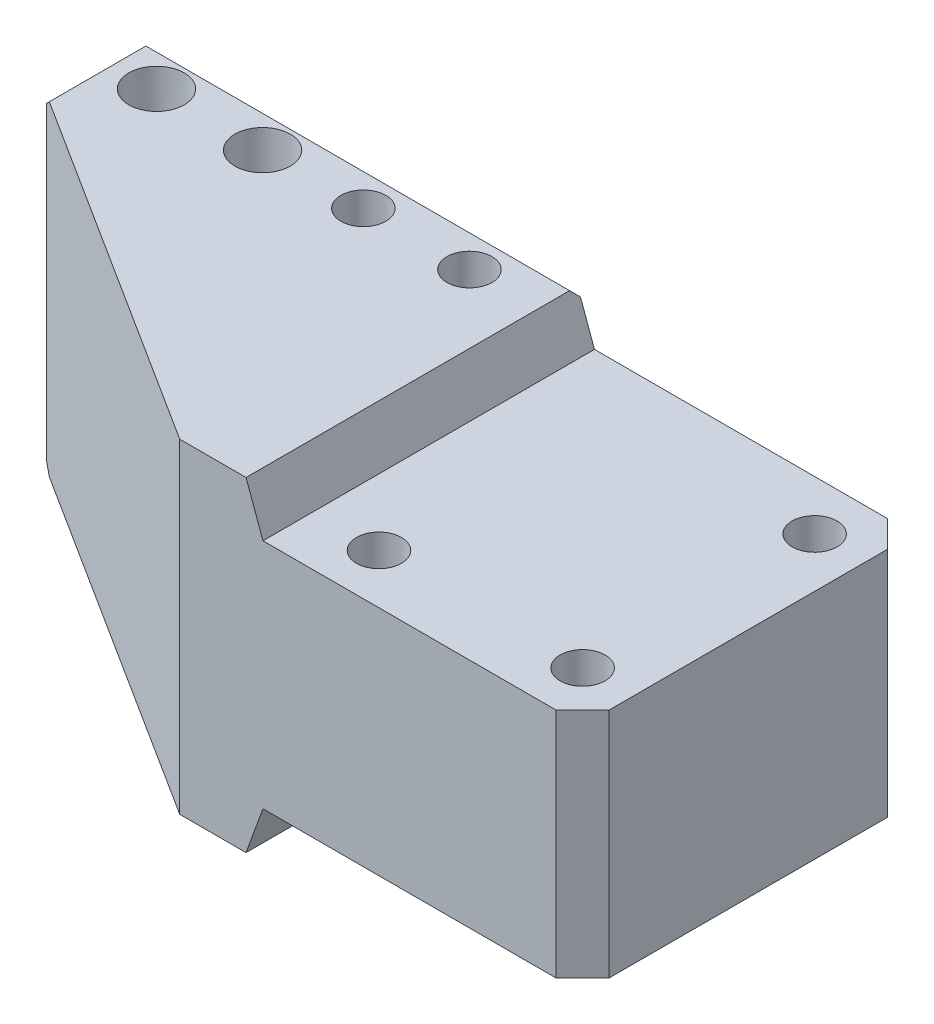
ISO-10303-21;
HEADER;
FILE_DESCRIPTION(('STEP AP214'),'2;1');
FILE_NAME('part.step','',(''),(''),'','','');
FILE_SCHEMA(('AUTOMOTIVE_DESIGN { 1 0 10303 214 1 1 1 1 }'));
ENDSEC;
DATA;
#1=APPLICATION_CONTEXT('core data for automotive mechanical design processes');
#2=APPLICATION_PROTOCOL_DEFINITION('international standard','automotive_design',2000,#1);
#3=PRODUCT_CONTEXT('',#1,'mechanical');
#4=PRODUCT('Part','Part','',(#3));
#5=PRODUCT_RELATED_PRODUCT_CATEGORY('part','',(#4));
#6=PRODUCT_DEFINITION_FORMATION('','',#4);
#7=PRODUCT_DEFINITION_CONTEXT('part definition',#1,'design');
#8=PRODUCT_DEFINITION('design','',#6,#7);
#9=PRODUCT_DEFINITION_SHAPE('','',#8);
#10=(LENGTH_UNIT() NAMED_UNIT(*) SI_UNIT(.MILLI.,.METRE.));
#11=(NAMED_UNIT(*) PLANE_ANGLE_UNIT() SI_UNIT($,.RADIAN.));
#12=(NAMED_UNIT(*) SI_UNIT($,.STERADIAN.) SOLID_ANGLE_UNIT());
#13=UNCERTAINTY_MEASURE_WITH_UNIT(LENGTH_MEASURE(1.E-05),#10,'distance_accuracy_value','');
#14=(GEOMETRIC_REPRESENTATION_CONTEXT(3) GLOBAL_UNCERTAINTY_ASSIGNED_CONTEXT((#13)) GLOBAL_UNIT_ASSIGNED_CONTEXT((#10,
#11,#12)) REPRESENTATION_CONTEXT('',''));
#15=CARTESIAN_POINT('',(0.,0.,0.));
#16=DIRECTION('',(0.,0.,1.));
#17=DIRECTION('',(1.,0.,0.));
#18=AXIS2_PLACEMENT_3D('',#15,#16,#17);
#19=CARTESIAN_POINT('',(23.1488063819966,-25.146,12.7));
#20=DIRECTION('',(0.,1.,0.));
#21=DIRECTION('',(-1.,0.,0.));
#22=AXIS2_PLACEMENT_3D('',#19,#20,#21);
#23=PLANE('',#22);
#24=DIRECTION('',(-0.844133683721906,0.,-0.536132748492465));
#25=VECTOR('',#24,1.);
#26=CARTESIAN_POINT('',(15.1809586906833,-25.146,31.75));
#27=LINE('',#26,#25);
#28=CARTESIAN_POINT('',(15.1809586906833,-25.146,31.75));
#29=VERTEX_POINT('',#28);
#30=CARTESIAN_POINT('',(-19.05,-25.146,10.0089673646833));
#31=VERTEX_POINT('',#30);
#32=EDGE_CURVE('E152',#29,#31,#27,.T.);
#33=ORIENTED_EDGE('',*,*,#32,.T.);
#34=DIRECTION('',(0.,0.,-1.));
#35=VECTOR('',#34,1.);
#36=CARTESIAN_POINT('',(-19.05,-25.146,12.7));
#37=LINE('',#36,#35);
#38=CARTESIAN_POINT('',(-19.05,-25.146,0.761999999999999));
#39=VERTEX_POINT('',#38);
#40=EDGE_CURVE('E49',#31,#39,#37,.T.);
#41=ORIENTED_EDGE('',*,*,#40,.T.);
#42=DIRECTION('',(1.,0.,0.));
#43=VECTOR('',#42,1.);
#44=CARTESIAN_POINT('',(21.5309586906833,-25.146,0.761999999999999));
#45=LINE('',#44,#43);
#46=CARTESIAN_POINT('',(21.5309586906833,-25.146,0.761999999999999));
#47=VERTEX_POINT('',#46);
#48=EDGE_CURVE('E60',#39,#47,#45,.T.);
#49=ORIENTED_EDGE('',*,*,#48,.T.);
#50=DIRECTION('',(0.,0.,1.));
#51=VECTOR('',#50,1.);
#52=CARTESIAN_POINT('',(21.5309586906833,-25.146,12.7));
#53=LINE('',#52,#51);
#54=CARTESIAN_POINT('',(21.5309586906833,-25.146,31.75));
#55=VERTEX_POINT('',#54);
#56=EDGE_CURVE('E206',#55,#47,#53,.F.);
#57=ORIENTED_EDGE('',*,*,#56,.F.);
#58=DIRECTION('',(1.,0.,0.));
#59=VECTOR('',#58,1.);
#60=CARTESIAN_POINT('',(-19.812,-25.146,31.75));
#61=LINE('',#60,#59);
#62=EDGE_CURVE('E173',#29,#55,#61,.T.);
#63=ORIENTED_EDGE('',*,*,#62,.F.);
#64=EDGE_LOOP('',(#33,#41,#49,#57,#63));
#65=FACE_BOUND('',#64,.T.);
#66=CARTESIAN_POINT('',(-4.826,-25.146,3.81000000000003));
#67=DIRECTION('',(0.,-1.,0.));
#68=DIRECTION('',(0.,0.,-1.));
#69=AXIS2_PLACEMENT_3D('',#66,#67,#68);
#70=CIRCLE('',#69,2.15265);
#71=CARTESIAN_POINT('',(-4.826,-25.146,1.65735000000003));
#72=VERTEX_POINT('',#71);
#73=EDGE_CURVE('E663',#72,#72,#70,.T.);
#74=ORIENTED_EDGE('',*,*,#73,.F.);
#75=EDGE_LOOP('',(#74));
#76=FACE_BOUND('',#75,.T.);
#77=CARTESIAN_POINT('',(-14.986,-25.146,3.81000000000003));
#78=DIRECTION('',(0.,-1.,0.));
#79=DIRECTION('',(0.,0.,-1.));
#80=AXIS2_PLACEMENT_3D('',#77,#78,#79);
#81=CIRCLE('',#80,2.15265);
#82=CARTESIAN_POINT('',(-14.986,-25.146,1.65735000000003));
#83=VERTEX_POINT('',#82);
#84=EDGE_CURVE('E217',#83,#83,#81,.T.);
#85=ORIENTED_EDGE('',*,*,#84,.F.);
#86=EDGE_LOOP('',(#85));
#87=FACE_BOUND('',#86,.T.);
#88=CARTESIAN_POINT('',(14.986,-25.146,3.81000000000001));
#89=DIRECTION('',(0.,-1.,0.));
#90=DIRECTION('',(0.,0.,-1.));
#91=AXIS2_PLACEMENT_3D('',#88,#89,#90);
#92=CIRCLE('',#91,2.65430000000001);
#93=CARTESIAN_POINT('',(14.986,-25.146,1.1557));
#94=VERTEX_POINT('',#93);
#95=EDGE_CURVE('E232',#94,#94,#92,.T.);
#96=ORIENTED_EDGE('',*,*,#95,.F.);
#97=EDGE_LOOP('',(#96));
#98=FACE_BOUND('',#97,.T.);
#99=CARTESIAN_POINT('',(4.826,-25.146,3.81000000000001));
#100=DIRECTION('',(0.,-1.,0.));
#101=DIRECTION('',(0.,0.,-1.));
#102=AXIS2_PLACEMENT_3D('',#99,#100,#101);
#103=CIRCLE('',#102,2.65430000000001);
#104=CARTESIAN_POINT('',(4.826,-25.146,1.1557));
#105=VERTEX_POINT('',#104);
#106=EDGE_CURVE('E156',#105,#105,#103,.T.);
#107=ORIENTED_EDGE('',*,*,#106,.F.);
#108=EDGE_LOOP('',(#107));
#109=FACE_BOUND('',#108,.T.);
#110=ADVANCED_FACE('F40',(#65,#76,#87,#98,#109),#23,.F.);
#111=CARTESIAN_POINT('',(23.1488063819966,5.969,12.7));
#112=DIRECTION('',(0.,-1.,0.));
#113=DIRECTION('',(1.,0.,0.));
#114=AXIS2_PLACEMENT_3D('',#111,#112,#113);
#115=PLANE('',#114);
#116=DIRECTION('',(-1.,0.,0.));
#117=VECTOR('',#116,1.);
#118=CARTESIAN_POINT('',(-19.812,5.969,0.761999999999999));
#119=LINE('',#118,#117);
#120=CARTESIAN_POINT('',(21.5309586906833,5.969,0.761999999999999));
#121=VERTEX_POINT('',#120);
#122=CARTESIAN_POINT('',(-19.05,5.969,0.761999999999999));
#123=VERTEX_POINT('',#122);
#124=EDGE_CURVE('E258',#121,#123,#119,.T.);
#125=ORIENTED_EDGE('',*,*,#124,.T.);
#126=DIRECTION('',(0.,0.,1.));
#127=VECTOR('',#126,1.);
#128=CARTESIAN_POINT('',(-19.05,5.969,12.7));
#129=LINE('',#128,#127);
#130=CARTESIAN_POINT('',(-19.05,5.969,10.0089673646833));
#131=VERTEX_POINT('',#130);
#132=EDGE_CURVE('E167',#123,#131,#129,.T.);
#133=ORIENTED_EDGE('',*,*,#132,.T.);
#134=DIRECTION('',(-0.844133683721906,0.,-0.536132748492465));
#135=VECTOR('',#134,1.);
#136=CARTESIAN_POINT('',(15.1809586906833,5.969,31.75));
#137=LINE('',#136,#135);
#138=CARTESIAN_POINT('',(15.1809586906833,5.969,31.75));
#139=VERTEX_POINT('',#138);
#140=EDGE_CURVE('E150',#139,#131,#137,.T.);
#141=ORIENTED_EDGE('',*,*,#140,.F.);
#142=DIRECTION('',(-1.,0.,0.));
#143=VECTOR('',#142,1.);
#144=CARTESIAN_POINT('',(23.1488063819966,5.969,31.75));
#145=LINE('',#144,#143);
#146=CARTESIAN_POINT('',(21.5309586906833,5.969,31.75));
#147=VERTEX_POINT('',#146);
#148=EDGE_CURVE('E164',#147,#139,#145,.T.);
#149=ORIENTED_EDGE('',*,*,#148,.F.);
#150=DIRECTION('',(0.,0.,1.));
#151=VECTOR('',#150,1.);
#152=CARTESIAN_POINT('',(21.5309586906833,5.969,12.7));
#153=LINE('',#152,#151);
#154=EDGE_CURVE('E200',#147,#121,#153,.F.);
#155=ORIENTED_EDGE('',*,*,#154,.T.);
#156=EDGE_LOOP('',(#125,#133,#141,#149,#155));
#157=FACE_BOUND('',#156,.T.);
#158=CARTESIAN_POINT('',(4.826,5.969,3.81000000000001));
#159=DIRECTION('',(0.,1.,0.));
#160=DIRECTION('',(0.,0.,1.));
#161=AXIS2_PLACEMENT_3D('',#158,#159,#160);
#162=CIRCLE('',#161,2.15265);
#163=CARTESIAN_POINT('',(4.826,5.969,5.96265000000001));
#164=VERTEX_POINT('',#163);
#165=EDGE_CURVE('E669',#164,#164,#162,.T.);
#166=ORIENTED_EDGE('',*,*,#165,.F.);
#167=EDGE_LOOP('',(#166));
#168=FACE_BOUND('',#167,.T.);
#169=CARTESIAN_POINT('',(14.986,5.969,3.81000000000001));
#170=DIRECTION('',(0.,1.,0.));
#171=DIRECTION('',(0.,0.,1.));
#172=AXIS2_PLACEMENT_3D('',#169,#170,#171);
#173=CIRCLE('',#172,2.15265);
#174=CARTESIAN_POINT('',(14.986,5.969,5.96265000000001));
#175=VERTEX_POINT('',#174);
#176=EDGE_CURVE('E666',#175,#175,#173,.T.);
#177=ORIENTED_EDGE('',*,*,#176,.F.);
#178=EDGE_LOOP('',(#177));
#179=FACE_BOUND('',#178,.T.);
#180=CARTESIAN_POINT('',(-14.986,5.969,3.81000000000003));
#181=DIRECTION('',(0.,1.,0.));
#182=DIRECTION('',(0.,0.,1.));
#183=AXIS2_PLACEMENT_3D('',#180,#181,#182);
#184=CIRCLE('',#183,2.65430000000001);
#185=CARTESIAN_POINT('',(-14.986,5.969,6.46430000000004));
#186=VERTEX_POINT('',#185);
#187=EDGE_CURVE('E222',#186,#186,#184,.T.);
#188=ORIENTED_EDGE('',*,*,#187,.F.);
#189=EDGE_LOOP('',(#188));
#190=FACE_BOUND('',#189,.T.);
#191=CARTESIAN_POINT('',(-4.826,5.969,3.81000000000003));
#192=DIRECTION('',(0.,1.,0.));
#193=DIRECTION('',(0.,0.,1.));
#194=AXIS2_PLACEMENT_3D('',#191,#192,#193);
#195=CIRCLE('',#194,2.65430000000001);
#196=CARTESIAN_POINT('',(-4.826,5.969,6.46430000000004));
#197=VERTEX_POINT('',#196);
#198=EDGE_CURVE('E227',#197,#197,#195,.T.);
#199=ORIENTED_EDGE('',*,*,#198,.F.);
#200=EDGE_LOOP('',(#199));
#201=FACE_BOUND('',#200,.T.);
#202=ADVANCED_FACE('F161',(#157,#168,#179,#190,#201),#115,.F.);
#203=CARTESIAN_POINT('',(23.1488063819966,1.52400000000002,31.75));
#204=DIRECTION('',(0.939692620785908,0.34202014332567,0.));
#205=DIRECTION('',(-0.34202014332567,0.939692620785908,0.));
#206=AXIS2_PLACEMENT_3D('',#203,#204,#205);
#207=PLANE('',#206);
#208=DIRECTION('',(0.34202014332567,-0.939692620785908,0.));
#209=VECTOR('',#208,1.);
#210=CARTESIAN_POINT('',(20.9307145964622,7.61815709503341,0.));
#211=LINE('',#210,#209);
#212=CARTESIAN_POINT('',(23.1488063819966,1.52400000000002,0.));
#213=VERTEX_POINT('',#212);
#214=CARTESIAN_POINT('',(21.8083040091942,5.207,0.));
#215=VERTEX_POINT('',#214);
#216=EDGE_CURVE('E195',#213,#215,#211,.F.);
#217=ORIENTED_EDGE('',*,*,#216,.T.);
#218=DIRECTION('',(0.249243569363955,-0.684791078771736,-0.684791078771736));
#219=VECTOR('',#218,1.);
#220=CARTESIAN_POINT('',(21.6314632023232,5.69286612371603,0.48586612371603));
#221=LINE('',#220,#219);
#222=EDGE_CURVE('E271',#215,#121,#221,.F.);
#223=ORIENTED_EDGE('',*,*,#222,.T.);
#224=ORIENTED_EDGE('',*,*,#154,.F.);
#225=DIRECTION('',(0.34202014332567,-0.939692620785908,0.));
#226=VECTOR('',#225,1.);
#227=CARTESIAN_POINT('',(20.9307145964622,7.61815709503341,31.75));
#228=LINE('',#227,#226);
#229=CARTESIAN_POINT('',(23.1488063819966,1.52400000000002,31.75));
#230=VERTEX_POINT('',#229);
#231=EDGE_CURVE('E172',#230,#147,#228,.F.);
#232=ORIENTED_EDGE('',*,*,#231,.F.);
#233=DIRECTION('',(0.,0.,-1.));
#234=VECTOR('',#233,1.);
#235=CARTESIAN_POINT('',(23.1488063819966,1.52400000000002,31.75));
#236=LINE('',#235,#234);
#237=EDGE_CURVE('E199',#230,#213,#236,.T.);
#238=ORIENTED_EDGE('',*,*,#237,.T.);
#239=EDGE_LOOP('',(#217,#223,#224,#232,#238));
#240=FACE_BOUND('',#239,.T.);
#241=ADVANCED_FACE('F312',(#240),#207,.T.);
#242=CARTESIAN_POINT('',(23.1488063819966,-20.701,12.7));
#243=DIRECTION('',(0.939692620785908,-0.342020143325669,0.));
#244=DIRECTION('',(0.342020143325669,0.939692620785908,0.));
#245=AXIS2_PLACEMENT_3D('',#242,#243,#244);
#246=PLANE('',#245);
#247=ORIENTED_EDGE('',*,*,#56,.T.);
#248=DIRECTION('',(-0.249243569363955,-0.684791078771736,0.684791078771736));
#249=VECTOR('',#248,1.);
#250=CARTESIAN_POINT('',(21.6314632023232,-24.869866123716,0.485866123716031));
#251=LINE('',#250,#249);
#252=CARTESIAN_POINT('',(21.8083040091942,-24.384,0.));
#253=VERTEX_POINT('',#252);
#254=EDGE_CURVE('E11',#47,#253,#251,.F.);
#255=ORIENTED_EDGE('',*,*,#254,.T.);
#256=DIRECTION('',(-0.342020143325669,-0.939692620785908,0.));
#257=VECTOR('',#256,1.);
#258=CARTESIAN_POINT('',(27.0940835919416,-9.86143995218708,0.));
#259=LINE('',#258,#257);
#260=CARTESIAN_POINT('',(23.1488063819966,-20.701,0.));
#261=VERTEX_POINT('',#260);
#262=EDGE_CURVE('E204',#253,#261,#259,.F.);
#263=ORIENTED_EDGE('',*,*,#262,.T.);
#264=DIRECTION('',(0.,0.,-1.));
#265=VECTOR('',#264,1.);
#266=CARTESIAN_POINT('',(23.1488063819966,-20.701,12.7));
#267=LINE('',#266,#265);
#268=CARTESIAN_POINT('',(23.1488063819966,-20.701,31.75));
#269=VERTEX_POINT('',#268);
#270=EDGE_CURVE('E196',#269,#261,#267,.T.);
#271=ORIENTED_EDGE('',*,*,#270,.F.);
#272=DIRECTION('',(-0.342020143325669,-0.939692620785908,0.));
#273=VECTOR('',#272,1.);
#274=CARTESIAN_POINT('',(27.0940835919416,-9.86143995218708,31.75));
#275=LINE('',#274,#273);
#276=EDGE_CURVE('E177',#55,#269,#275,.F.);
#277=ORIENTED_EDGE('',*,*,#276,.F.);
#278=EDGE_LOOP('',(#247,#255,#263,#271,#277));
#279=FACE_BOUND('',#278,.T.);
#280=ADVANCED_FACE('F337',(#279),#246,.T.);
#281=CARTESIAN_POINT('',(-19.812,5.969,12.7));
#282=DIRECTION('',(1.,0.,0.));
#283=DIRECTION('',(0.,1.,0.));
#284=AXIS2_PLACEMENT_3D('',#281,#282,#283);
#285=PLANE('',#284);
#286=DIRECTION('',(0.,1.,0.));
#287=VECTOR('',#286,1.);
#288=CARTESIAN_POINT('',(-19.812,-25.146,9.525));
#289=LINE('',#288,#287);
#290=CARTESIAN_POINT('',(-19.812,-24.384,9.525));
#291=VERTEX_POINT('',#290);
#292=CARTESIAN_POINT('',(-19.812,5.20699999999999,9.525));
#293=VERTEX_POINT('',#292);
#294=EDGE_CURVE('E157',#291,#293,#289,.T.);
#295=ORIENTED_EDGE('',*,*,#294,.T.);
#296=DIRECTION('',(0.,0.,-1.));
#297=VECTOR('',#296,1.);
#298=CARTESIAN_POINT('',(-19.812,5.207,12.7));
#299=LINE('',#298,#297);
#300=CARTESIAN_POINT('',(-19.812,5.207,0.761999999999999));
#301=VERTEX_POINT('',#300);
#302=EDGE_CURVE('E255',#293,#301,#299,.T.);
#303=ORIENTED_EDGE('',*,*,#302,.T.);
#304=DIRECTION('',(0.,-1.,0.));
#305=VECTOR('',#304,1.);
#306=CARTESIAN_POINT('',(-19.812,-25.146,0.761999999999999));
#307=LINE('',#306,#305);
#308=CARTESIAN_POINT('',(-19.812,-24.384,0.761999999999999));
#309=VERTEX_POINT('',#308);
#310=EDGE_CURVE('E251',#301,#309,#307,.T.);
#311=ORIENTED_EDGE('',*,*,#310,.T.);
#312=DIRECTION('',(0.,0.,1.));
#313=VECTOR('',#312,1.);
#314=CARTESIAN_POINT('',(-19.812,-24.384,12.7));
#315=LINE('',#314,#313);
#316=EDGE_CURVE('E253',#309,#291,#315,.T.);
#317=ORIENTED_EDGE('',*,*,#316,.T.);
#318=EDGE_LOOP('',(#295,#303,#311,#317));
#319=FACE_BOUND('',#318,.T.);
#320=ADVANCED_FACE('F357',(#319),#285,.F.);
#321=CARTESIAN_POINT('',(0.,0.,0.));
#322=DIRECTION('',(0.,0.,-1.));
#323=DIRECTION('',(-1.,0.,0.));
#324=AXIS2_PLACEMENT_3D('',#321,#322,#323);
#325=PLANE('',#324);
#326=DIRECTION('',(0.,1.,0.));
#327=VECTOR('',#326,1.);
#328=CARTESIAN_POINT('',(-19.05,5.969,0.));
#329=LINE('',#328,#327);
#330=CARTESIAN_POINT('',(-19.05,-24.384,0.));
#331=VERTEX_POINT('',#330);
#332=CARTESIAN_POINT('',(-19.05,5.207,0.));
#333=VERTEX_POINT('',#332);
#334=EDGE_CURVE('E267',#331,#333,#329,.T.);
#335=ORIENTED_EDGE('',*,*,#334,.T.);
#336=DIRECTION('',(1.,0.,0.));
#337=VECTOR('',#336,1.);
#338=CARTESIAN_POINT('',(21.5309586906833,5.207,0.));
#339=LINE('',#338,#337);
#340=EDGE_CURVE('E269',#333,#215,#339,.T.);
#341=ORIENTED_EDGE('',*,*,#340,.T.);
#342=ORIENTED_EDGE('',*,*,#216,.F.);
#343=DIRECTION('',(-1.,0.,0.));
#344=VECTOR('',#343,1.);
#345=CARTESIAN_POINT('',(53.7590774917169,1.52400000000003,0.));
#346=LINE('',#345,#344);
#347=CARTESIAN_POINT('',(51.2190774917169,1.52400000000003,0.));
#348=VERTEX_POINT('',#347);
#349=EDGE_CURVE('E181',#348,#213,#346,.T.);
#350=ORIENTED_EDGE('',*,*,#349,.F.);
#351=DIRECTION('',(0.,-1.,0.));
#352=VECTOR('',#351,1.);
#353=CARTESIAN_POINT('',(51.2190774917169,0.,0.));
#354=LINE('',#353,#352);
#355=CARTESIAN_POINT('',(51.2190774917169,-20.701,0.));
#356=VERTEX_POINT('',#355);
#357=EDGE_CURVE('E248',#348,#356,#354,.T.);
#358=ORIENTED_EDGE('',*,*,#357,.T.);
#359=DIRECTION('',(1.,0.,0.));
#360=VECTOR('',#359,1.);
#361=CARTESIAN_POINT('',(53.7590774917169,-20.701,0.));
#362=LINE('',#361,#360);
#363=EDGE_CURVE('E175',#261,#356,#362,.T.);
#364=ORIENTED_EDGE('',*,*,#363,.F.);
#365=ORIENTED_EDGE('',*,*,#262,.F.);
#366=DIRECTION('',(-1.,0.,0.));
#367=VECTOR('',#366,1.);
#368=CARTESIAN_POINT('',(-19.812,-24.384,0.));
#369=LINE('',#368,#367);
#370=EDGE_CURVE('E265',#253,#331,#369,.T.);
#371=ORIENTED_EDGE('',*,*,#370,.T.);
#372=EDGE_LOOP('',(#335,#341,#342,#350,#358,#364,#365,#371));
#373=FACE_BOUND('',#372,.T.);
#374=ADVANCED_FACE('F302',(#373),#325,.T.);
#375=CARTESIAN_POINT('',(23.1488063819966,1.52400000000002,31.75));
#376=DIRECTION('',(0.,-1.,0.));
#377=DIRECTION('',(1.,0.,0.));
#378=AXIS2_PLACEMENT_3D('',#375,#376,#377);
#379=PLANE('',#378);
#380=CARTESIAN_POINT('',(48.9965774917169,1.52400000000003,26.9875));
#381=DIRECTION('',(0.,-1.,0.));
#382=DIRECTION('',(1.,0.,0.));
#383=AXIS2_PLACEMENT_3D('',#380,#381,#382);
#384=CIRCLE('',#383,2.15265);
#385=CARTESIAN_POINT('',(51.1492274917169,1.52400000000003,26.9875));
#386=VERTEX_POINT('',#385);
#387=EDGE_CURVE('E675',#386,#386,#384,.T.);
#388=ORIENTED_EDGE('',*,*,#387,.T.);
#389=EDGE_LOOP('',(#388));
#390=FACE_BOUND('',#389,.T.);
#391=CARTESIAN_POINT('',(48.9965774917169,1.52400000000003,4.7625));
#392=DIRECTION('',(0.,-1.,0.));
#393=DIRECTION('',(1.,0.,0.));
#394=AXIS2_PLACEMENT_3D('',#391,#392,#393);
#395=CIRCLE('',#394,2.15265);
#396=CARTESIAN_POINT('',(51.1492274917169,1.52400000000003,4.7625));
#397=VERTEX_POINT('',#396);
#398=EDGE_CURVE('E681',#397,#397,#395,.T.);
#399=ORIENTED_EDGE('',*,*,#398,.T.);
#400=EDGE_LOOP('',(#399));
#401=FACE_BOUND('',#400,.T.);
#402=CARTESIAN_POINT('',(29.4988063819966,1.52400000000002,26.9875));
#403=DIRECTION('',(0.,-1.,0.));
#404=DIRECTION('',(1.,0.,0.));
#405=AXIS2_PLACEMENT_3D('',#402,#403,#404);
#406=CIRCLE('',#405,2.15265);
#407=CARTESIAN_POINT('',(31.6514563819966,1.52400000000002,26.9875));
#408=VERTEX_POINT('',#407);
#409=EDGE_CURVE('E209',#408,#408,#406,.T.);
#410=ORIENTED_EDGE('',*,*,#409,.T.);
#411=EDGE_LOOP('',(#410));
#412=FACE_BOUND('',#411,.T.);
#413=DIRECTION('',(-1.,0.,0.));
#414=VECTOR('',#413,1.);
#415=CARTESIAN_POINT('',(23.1488063819966,1.52400000000002,31.75));
#416=LINE('',#415,#414);
#417=CARTESIAN_POINT('',(51.2190774917169,1.52400000000003,31.75));
#418=VERTEX_POINT('',#417);
#419=EDGE_CURVE('E187',#418,#230,#416,.T.);
#420=ORIENTED_EDGE('',*,*,#419,.F.);
#421=DIRECTION('',(0.707106781186549,0.,-0.707106781186546));
#422=VECTOR('',#421,1.);
#423=CARTESIAN_POINT('',(53.7590774917169,1.52400000000003,29.21));
#424=LINE('',#423,#422);
#425=CARTESIAN_POINT('',(53.7590774917169,1.52400000000003,29.21));
#426=VERTEX_POINT('',#425);
#427=EDGE_CURVE('E246',#418,#426,#424,.T.);
#428=ORIENTED_EDGE('',*,*,#427,.T.);
#429=DIRECTION('',(0.,0.,-1.));
#430=VECTOR('',#429,1.);
#431=CARTESIAN_POINT('',(53.7590774917169,1.52400000000003,31.75));
#432=LINE('',#431,#430);
#433=CARTESIAN_POINT('',(53.7590774917169,1.52400000000003,2.53999999999999));
#434=VERTEX_POINT('',#433);
#435=EDGE_CURVE('E183',#426,#434,#432,.T.);
#436=ORIENTED_EDGE('',*,*,#435,.T.);
#437=DIRECTION('',(0.707106781186546,0.,0.707106781186549));
#438=VECTOR('',#437,1.);
#439=CARTESIAN_POINT('',(51.2190774917169,1.52400000000003,0.));
#440=LINE('',#439,#438);
#441=EDGE_CURVE('E244',#434,#348,#440,.F.);
#442=ORIENTED_EDGE('',*,*,#441,.T.);
#443=ORIENTED_EDGE('',*,*,#349,.T.);
#444=ORIENTED_EDGE('',*,*,#237,.F.);
#445=EDGE_LOOP('',(#420,#428,#436,#442,#443,#444));
#446=FACE_BOUND('',#445,.T.);
#447=ADVANCED_FACE('F518',(#390,#401,#412,#446),#379,.F.);
#448=CARTESIAN_POINT('',(23.1488063819966,-20.701,31.75));
#449=DIRECTION('',(0.,1.,0.));
#450=DIRECTION('',(-1.,0.,0.));
#451=AXIS2_PLACEMENT_3D('',#448,#449,#450);
#452=PLANE('',#451);
#453=CARTESIAN_POINT('',(48.9965774917169,-20.701,26.9875));
#454=DIRECTION('',(0.,-1.,0.));
#455=DIRECTION('',(0.,0.,-1.));
#456=AXIS2_PLACEMENT_3D('',#453,#454,#455);
#457=CIRCLE('',#456,2.15265);
#458=CARTESIAN_POINT('',(48.9965774917169,-20.701,24.83485));
#459=VERTEX_POINT('',#458);
#460=EDGE_CURVE('E672',#459,#459,#457,.T.);
#461=ORIENTED_EDGE('',*,*,#460,.F.);
#462=EDGE_LOOP('',(#461));
#463=FACE_BOUND('',#462,.T.);
#464=CARTESIAN_POINT('',(48.9965774917169,-20.701,4.7625));
#465=DIRECTION('',(0.,-1.,0.));
#466=DIRECTION('',(0.,0.,-1.));
#467=AXIS2_PLACEMENT_3D('',#464,#465,#466);
#468=CIRCLE('',#467,2.15265);
#469=CARTESIAN_POINT('',(48.9965774917169,-20.701,2.60985));
#470=VERTEX_POINT('',#469);
#471=EDGE_CURVE('E678',#470,#470,#468,.T.);
#472=ORIENTED_EDGE('',*,*,#471,.F.);
#473=EDGE_LOOP('',(#472));
#474=FACE_BOUND('',#473,.T.);
#475=CARTESIAN_POINT('',(29.4988063819966,-20.701,26.9875));
#476=DIRECTION('',(0.,-1.,0.));
#477=DIRECTION('',(0.,0.,-1.));
#478=AXIS2_PLACEMENT_3D('',#475,#476,#477);
#479=CIRCLE('',#478,2.15265);
#480=CARTESIAN_POINT('',(29.4988063819966,-20.701,24.83485));
#481=VERTEX_POINT('',#480);
#482=EDGE_CURVE('E684',#481,#481,#479,.T.);
#483=ORIENTED_EDGE('',*,*,#482,.F.);
#484=EDGE_LOOP('',(#483));
#485=FACE_BOUND('',#484,.T.);
#486=DIRECTION('',(0.,0.,1.));
#487=VECTOR('',#486,1.);
#488=CARTESIAN_POINT('',(53.7590774917169,-20.701,31.75));
#489=LINE('',#488,#487);
#490=CARTESIAN_POINT('',(53.7590774917169,-20.701,2.53999999999999));
#491=VERTEX_POINT('',#490);
#492=CARTESIAN_POINT('',(53.7590774917169,-20.701,29.21));
#493=VERTEX_POINT('',#492);
#494=EDGE_CURVE('E184',#491,#493,#489,.T.);
#495=ORIENTED_EDGE('',*,*,#494,.T.);
#496=DIRECTION('',(-0.707106781186549,0.,0.707106781186546));
#497=VECTOR('',#496,1.);
#498=CARTESIAN_POINT('',(53.7590774917169,-20.701,29.21));
#499=LINE('',#498,#497);
#500=CARTESIAN_POINT('',(51.2190774917169,-20.701,31.75));
#501=VERTEX_POINT('',#500);
#502=EDGE_CURVE('E240',#493,#501,#499,.T.);
#503=ORIENTED_EDGE('',*,*,#502,.T.);
#504=DIRECTION('',(1.,0.,0.));
#505=VECTOR('',#504,1.);
#506=CARTESIAN_POINT('',(23.1488063819966,-20.701,31.75));
#507=LINE('',#506,#505);
#508=EDGE_CURVE('E193',#269,#501,#507,.T.);
#509=ORIENTED_EDGE('',*,*,#508,.F.);
#510=ORIENTED_EDGE('',*,*,#270,.T.);
#511=ORIENTED_EDGE('',*,*,#363,.T.);
#512=DIRECTION('',(-0.707106781186546,0.,-0.707106781186549));
#513=VECTOR('',#512,1.);
#514=CARTESIAN_POINT('',(51.2190774917169,-20.701,0.));
#515=LINE('',#514,#513);
#516=EDGE_CURVE('E238',#356,#491,#515,.F.);
#517=ORIENTED_EDGE('',*,*,#516,.T.);
#518=EDGE_LOOP('',(#495,#503,#509,#510,#511,#517));
#519=FACE_BOUND('',#518,.T.);
#520=ADVANCED_FACE('F324',(#463,#474,#485,#519),#452,.F.);
#521=CARTESIAN_POINT('',(0.,0.,31.75));
#522=DIRECTION('',(0.,0.,-1.));
#523=DIRECTION('',(-1.,0.,0.));
#524=AXIS2_PLACEMENT_3D('',#521,#522,#523);
#525=PLANE('',#524);
#526=ORIENTED_EDGE('',*,*,#508,.T.);
#527=DIRECTION('',(0.,1.,0.));
#528=VECTOR('',#527,1.);
#529=CARTESIAN_POINT('',(51.2190774917169,1.52400000000003,31.75));
#530=LINE('',#529,#528);
#531=EDGE_CURVE('E242',#501,#418,#530,.T.);
#532=ORIENTED_EDGE('',*,*,#531,.T.);
#533=ORIENTED_EDGE('',*,*,#419,.T.);
#534=ORIENTED_EDGE('',*,*,#231,.T.);
#535=ORIENTED_EDGE('',*,*,#148,.T.);
#536=DIRECTION('',(0.,1.,0.));
#537=VECTOR('',#536,1.);
#538=CARTESIAN_POINT('',(15.1809586906833,-25.146,31.75));
#539=LINE('',#538,#537);
#540=EDGE_CURVE('E147',#29,#139,#539,.T.);
#541=ORIENTED_EDGE('',*,*,#540,.F.);
#542=ORIENTED_EDGE('',*,*,#62,.T.);
#543=ORIENTED_EDGE('',*,*,#276,.T.);
#544=EDGE_LOOP('',(#526,#532,#533,#534,#535,#541,#542,#543));
#545=FACE_BOUND('',#544,.T.);
#546=ADVANCED_FACE('F170',(#545),#525,.F.);
#547=CARTESIAN_POINT('',(53.7590774917169,45.6267345797353,31.75));
#548=DIRECTION('',(1.,0.,0.));
#549=DIRECTION('',(0.,0.,-1.));
#550=AXIS2_PLACEMENT_3D('',#547,#548,#549);
#551=PLANE('',#550);
#552=ORIENTED_EDGE('',*,*,#435,.F.);
#553=DIRECTION('',(0.,-1.,0.));
#554=VECTOR('',#553,1.);
#555=CARTESIAN_POINT('',(53.7590774917169,-20.701,29.21));
#556=LINE('',#555,#554);
#557=EDGE_CURVE('E235',#426,#493,#556,.T.);
#558=ORIENTED_EDGE('',*,*,#557,.T.);
#559=ORIENTED_EDGE('',*,*,#494,.F.);
#560=DIRECTION('',(0.,1.,0.));
#561=VECTOR('',#560,1.);
#562=CARTESIAN_POINT('',(53.7590774917169,45.6267345797353,2.53999999999999));
#563=LINE('',#562,#561);
#564=EDGE_CURVE('E203',#491,#434,#563,.T.);
#565=ORIENTED_EDGE('',*,*,#564,.T.);
#566=EDGE_LOOP('',(#552,#558,#559,#565));
#567=FACE_BOUND('',#566,.T.);
#568=ADVANCED_FACE('F327',(#567),#551,.T.);
#569=CARTESIAN_POINT('',(29.4988063819966,-20.701,26.9875));
#570=DIRECTION('',(0.,-1.,0.));
#571=DIRECTION('',(0.,0.,-1.));
#572=AXIS2_PLACEMENT_3D('',#569,#570,#571);
#573=CYLINDRICAL_SURFACE('',#572,2.15265);
#574=ORIENTED_EDGE('',*,*,#482,.T.);
#575=EDGE_LOOP('',(#574));
#576=FACE_BOUND('',#575,.T.);
#577=ORIENTED_EDGE('',*,*,#409,.F.);
#578=EDGE_LOOP('',(#577));
#579=FACE_BOUND('',#578,.T.);
#580=ADVANCED_FACE('F544',(#576,#579),#573,.F.);
#581=CARTESIAN_POINT('',(48.9965774917169,-20.701,4.7625));
#582=DIRECTION('',(0.,-1.,0.));
#583=DIRECTION('',(0.,0.,-1.));
#584=AXIS2_PLACEMENT_3D('',#581,#582,#583);
#585=CYLINDRICAL_SURFACE('',#584,2.15265);
#586=ORIENTED_EDGE('',*,*,#471,.T.);
#587=EDGE_LOOP('',(#586));
#588=FACE_BOUND('',#587,.T.);
#589=ORIENTED_EDGE('',*,*,#398,.F.);
#590=EDGE_LOOP('',(#589));
#591=FACE_BOUND('',#590,.T.);
#592=ADVANCED_FACE('F551',(#588,#591),#585,.F.);
#593=CARTESIAN_POINT('',(48.9965774917169,-20.701,26.9875));
#594=DIRECTION('',(0.,-1.,0.));
#595=DIRECTION('',(0.,0.,-1.));
#596=AXIS2_PLACEMENT_3D('',#593,#594,#595);
#597=CYLINDRICAL_SURFACE('',#596,2.15265);
#598=ORIENTED_EDGE('',*,*,#460,.T.);
#599=EDGE_LOOP('',(#598));
#600=FACE_BOUND('',#599,.T.);
#601=ORIENTED_EDGE('',*,*,#387,.F.);
#602=EDGE_LOOP('',(#601));
#603=FACE_BOUND('',#602,.T.);
#604=ADVANCED_FACE('F559',(#600,#603),#597,.F.);
#605=CARTESIAN_POINT('',(4.826,5.969,3.81000000000001));
#606=DIRECTION('',(0.,1.,0.));
#607=DIRECTION('',(0.,0.,1.));
#608=AXIS2_PLACEMENT_3D('',#605,#606,#607);
#609=CYLINDRICAL_SURFACE('',#608,2.15264999999999);
#610=CARTESIAN_POINT('',(4.826,-21.336,3.81000000000001));
#611=DIRECTION('',(0.,1.,0.));
#612=DIRECTION('',(0.,0.,1.));
#613=AXIS2_PLACEMENT_3D('',#610,#611,#612);
#614=CIRCLE('',#613,2.15264999999999);
#615=CARTESIAN_POINT('',(4.826,-21.336,5.96265000000001));
#616=VERTEX_POINT('',#615);
#617=EDGE_CURVE('E229',#616,#616,#614,.F.);
#618=ORIENTED_EDGE('',*,*,#617,.T.);
#619=EDGE_LOOP('',(#618));
#620=FACE_BOUND('',#619,.T.);
#621=ORIENTED_EDGE('',*,*,#165,.T.);
#622=EDGE_LOOP('',(#621));
#623=FACE_BOUND('',#622,.T.);
#624=ADVANCED_FACE('F567',(#620,#623),#609,.F.);
#625=CARTESIAN_POINT('',(14.986,5.969,3.81000000000001));
#626=DIRECTION('',(0.,1.,0.));
#627=DIRECTION('',(0.,0.,1.));
#628=AXIS2_PLACEMENT_3D('',#625,#626,#627);
#629=CYLINDRICAL_SURFACE('',#628,2.15264999999999);
#630=CARTESIAN_POINT('',(14.986,-21.336,3.81000000000001));
#631=DIRECTION('',(0.,1.,0.));
#632=DIRECTION('',(0.,0.,1.));
#633=AXIS2_PLACEMENT_3D('',#630,#631,#632);
#634=CIRCLE('',#633,2.15264999999999);
#635=CARTESIAN_POINT('',(14.986,-21.336,5.96265000000001));
#636=VERTEX_POINT('',#635);
#637=EDGE_CURVE('E224',#636,#636,#634,.F.);
#638=ORIENTED_EDGE('',*,*,#637,.T.);
#639=EDGE_LOOP('',(#638));
#640=FACE_BOUND('',#639,.T.);
#641=ORIENTED_EDGE('',*,*,#176,.T.);
#642=EDGE_LOOP('',(#641));
#643=FACE_BOUND('',#642,.T.);
#644=ADVANCED_FACE('F576',(#640,#643),#629,.F.);
#645=CARTESIAN_POINT('',(-4.826,-25.146,3.81000000000003));
#646=DIRECTION('',(0.,-1.,0.));
#647=DIRECTION('',(0.,0.,-1.));
#648=AXIS2_PLACEMENT_3D('',#645,#646,#647);
#649=CYLINDRICAL_SURFACE('',#648,2.15264999999999);
#650=CARTESIAN_POINT('',(-4.826,2.159,3.81000000000003));
#651=DIRECTION('',(0.,-1.,0.));
#652=DIRECTION('',(0.,0.,-1.));
#653=AXIS2_PLACEMENT_3D('',#650,#651,#652);
#654=CIRCLE('',#653,2.15264999999999);
#655=CARTESIAN_POINT('',(-4.826,2.159,1.65735000000003));
#656=VERTEX_POINT('',#655);
#657=EDGE_CURVE('E219',#656,#656,#654,.F.);
#658=ORIENTED_EDGE('',*,*,#657,.T.);
#659=EDGE_LOOP('',(#658));
#660=FACE_BOUND('',#659,.T.);
#661=ORIENTED_EDGE('',*,*,#73,.T.);
#662=EDGE_LOOP('',(#661));
#663=FACE_BOUND('',#662,.T.);
#664=ADVANCED_FACE('F584',(#660,#663),#649,.F.);
#665=CARTESIAN_POINT('',(-14.986,-25.146,3.81000000000003));
#666=DIRECTION('',(0.,-1.,0.));
#667=DIRECTION('',(0.,0.,-1.));
#668=AXIS2_PLACEMENT_3D('',#665,#666,#667);
#669=CYLINDRICAL_SURFACE('',#668,2.15264999999999);
#670=CARTESIAN_POINT('',(-14.986,2.159,3.81000000000003));
#671=DIRECTION('',(0.,-1.,0.));
#672=DIRECTION('',(0.,0.,-1.));
#673=AXIS2_PLACEMENT_3D('',#670,#671,#672);
#674=CIRCLE('',#673,2.15264999999999);
#675=CARTESIAN_POINT('',(-14.986,2.159,1.65735000000003));
#676=VERTEX_POINT('',#675);
#677=EDGE_CURVE('E214',#676,#676,#674,.F.);
#678=ORIENTED_EDGE('',*,*,#677,.T.);
#679=EDGE_LOOP('',(#678));
#680=FACE_BOUND('',#679,.T.);
#681=ORIENTED_EDGE('',*,*,#84,.T.);
#682=EDGE_LOOP('',(#681));
#683=FACE_BOUND('',#682,.T.);
#684=ADVANCED_FACE('F591',(#680,#683),#669,.F.);
#685=CARTESIAN_POINT('',(-14.986,2.159,3.81000000000003));
#686=DIRECTION('',(0.,-1.,0.));
#687=DIRECTION('',(0.,0.,-1.));
#688=AXIS2_PLACEMENT_3D('',#685,#686,#687);
#689=PLANE('',#688);
#690=CARTESIAN_POINT('',(-14.986,2.159,3.81000000000003));
#691=DIRECTION('',(0.,1.,0.));
#692=DIRECTION('',(0.,0.,1.));
#693=AXIS2_PLACEMENT_3D('',#690,#691,#692);
#694=CIRCLE('',#693,2.52730000000001);
#695=CARTESIAN_POINT('',(-14.986,2.159,6.33730000000004));
#696=VERTEX_POINT('',#695);
#697=EDGE_CURVE('E218',#696,#696,#694,.T.);
#698=ORIENTED_EDGE('',*,*,#697,.T.);
#699=EDGE_LOOP('',(#698));
#700=FACE_BOUND('',#699,.T.);
#701=ORIENTED_EDGE('',*,*,#677,.F.);
#702=EDGE_LOOP('',(#701));
#703=FACE_BOUND('',#702,.T.);
#704=ADVANCED_FACE('F599',(#700,#703),#689,.F.);
#705=CARTESIAN_POINT('',(-14.986,5.969,3.81000000000003));
#706=DIRECTION('',(0.,1.,0.));
#707=DIRECTION('',(0.,0.,1.));
#708=AXIS2_PLACEMENT_3D('',#705,#706,#707);
#709=CONICAL_SURFACE('',#708,2.65430000000001,0.0333209958782469);
#710=ORIENTED_EDGE('',*,*,#697,.F.);
#711=EDGE_LOOP('',(#710));
#712=FACE_BOUND('',#711,.T.);
#713=ORIENTED_EDGE('',*,*,#187,.T.);
#714=EDGE_LOOP('',(#713));
#715=FACE_BOUND('',#714,.T.);
#716=ADVANCED_FACE('F607',(#712,#715),#709,.F.);
#717=CARTESIAN_POINT('',(-4.826,2.159,3.81000000000003));
#718=DIRECTION('',(0.,-1.,0.));
#719=DIRECTION('',(0.,0.,-1.));
#720=AXIS2_PLACEMENT_3D('',#717,#718,#719);
#721=PLANE('',#720);
#722=CARTESIAN_POINT('',(-4.826,2.159,3.81000000000003));
#723=DIRECTION('',(0.,1.,0.));
#724=DIRECTION('',(0.,0.,1.));
#725=AXIS2_PLACEMENT_3D('',#722,#723,#724);
#726=CIRCLE('',#725,2.52730000000001);
#727=CARTESIAN_POINT('',(-4.826,2.159,6.33730000000004));
#728=VERTEX_POINT('',#727);
#729=EDGE_CURVE('E223',#728,#728,#726,.T.);
#730=ORIENTED_EDGE('',*,*,#729,.T.);
#731=EDGE_LOOP('',(#730));
#732=FACE_BOUND('',#731,.T.);
#733=ORIENTED_EDGE('',*,*,#657,.F.);
#734=EDGE_LOOP('',(#733));
#735=FACE_BOUND('',#734,.T.);
#736=ADVANCED_FACE('F614',(#732,#735),#721,.F.);
#737=CARTESIAN_POINT('',(-4.826,5.969,3.81000000000003));
#738=DIRECTION('',(0.,1.,0.));
#739=DIRECTION('',(0.,0.,1.));
#740=AXIS2_PLACEMENT_3D('',#737,#738,#739);
#741=CONICAL_SURFACE('',#740,2.65430000000001,0.0333209958782472);
#742=ORIENTED_EDGE('',*,*,#729,.F.);
#743=EDGE_LOOP('',(#742));
#744=FACE_BOUND('',#743,.T.);
#745=ORIENTED_EDGE('',*,*,#198,.T.);
#746=EDGE_LOOP('',(#745));
#747=FACE_BOUND('',#746,.T.);
#748=ADVANCED_FACE('F473',(#744,#747),#741,.F.);
#749=CARTESIAN_POINT('',(14.986,-21.336,3.81000000000001));
#750=DIRECTION('',(0.,1.,0.));
#751=DIRECTION('',(0.,0.,1.));
#752=AXIS2_PLACEMENT_3D('',#749,#750,#751);
#753=PLANE('',#752);
#754=CARTESIAN_POINT('',(14.986,-21.336,3.81000000000001));
#755=DIRECTION('',(0.,-1.,0.));
#756=DIRECTION('',(0.,0.,-1.));
#757=AXIS2_PLACEMENT_3D('',#754,#755,#756);
#758=CIRCLE('',#757,2.52730000000001);
#759=CARTESIAN_POINT('',(14.986,-21.336,1.2827));
#760=VERTEX_POINT('',#759);
#761=EDGE_CURVE('E228',#760,#760,#758,.T.);
#762=ORIENTED_EDGE('',*,*,#761,.T.);
#763=EDGE_LOOP('',(#762));
#764=FACE_BOUND('',#763,.T.);
#765=ORIENTED_EDGE('',*,*,#637,.F.);
#766=EDGE_LOOP('',(#765));
#767=FACE_BOUND('',#766,.T.);
#768=ADVANCED_FACE('F464',(#764,#767),#753,.F.);
#769=CARTESIAN_POINT('',(14.986,-25.146,3.81000000000001));
#770=DIRECTION('',(0.,-1.,0.));
#771=DIRECTION('',(0.,0.,-1.));
#772=AXIS2_PLACEMENT_3D('',#769,#770,#771);
#773=CONICAL_SURFACE('',#772,2.65430000000001,0.0333209958782469);
#774=ORIENTED_EDGE('',*,*,#761,.F.);
#775=EDGE_LOOP('',(#774));
#776=FACE_BOUND('',#775,.T.);
#777=ORIENTED_EDGE('',*,*,#95,.T.);
#778=EDGE_LOOP('',(#777));
#779=FACE_BOUND('',#778,.T.);
#780=ADVANCED_FACE('F455',(#776,#779),#773,.F.);
#781=CARTESIAN_POINT('',(4.826,-21.336,3.81000000000001));
#782=DIRECTION('',(0.,1.,0.));
#783=DIRECTION('',(0.,0.,1.));
#784=AXIS2_PLACEMENT_3D('',#781,#782,#783);
#785=PLANE('',#784);
#786=CARTESIAN_POINT('',(4.826,-21.336,3.81000000000001));
#787=DIRECTION('',(0.,-1.,0.));
#788=DIRECTION('',(0.,0.,-1.));
#789=AXIS2_PLACEMENT_3D('',#786,#787,#788);
#790=CIRCLE('',#789,2.52730000000001);
#791=CARTESIAN_POINT('',(4.826,-21.336,1.2827));
#792=VERTEX_POINT('',#791);
#793=EDGE_CURVE('E233',#792,#792,#790,.T.);
#794=ORIENTED_EDGE('',*,*,#793,.T.);
#795=EDGE_LOOP('',(#794));
#796=FACE_BOUND('',#795,.T.);
#797=ORIENTED_EDGE('',*,*,#617,.F.);
#798=EDGE_LOOP('',(#797));
#799=FACE_BOUND('',#798,.T.);
#800=ADVANCED_FACE('F445',(#796,#799),#785,.F.);
#801=CARTESIAN_POINT('',(4.826,-25.146,3.81000000000001));
#802=DIRECTION('',(0.,-1.,0.));
#803=DIRECTION('',(0.,0.,-1.));
#804=AXIS2_PLACEMENT_3D('',#801,#802,#803);
#805=CONICAL_SURFACE('',#804,2.65430000000001,0.0333209958782473);
#806=ORIENTED_EDGE('',*,*,#793,.F.);
#807=EDGE_LOOP('',(#806));
#808=FACE_BOUND('',#807,.T.);
#809=ORIENTED_EDGE('',*,*,#106,.T.);
#810=EDGE_LOOP('',(#809));
#811=FACE_BOUND('',#810,.T.);
#812=ADVANCED_FACE('F436',(#808,#811),#805,.F.);
#813=CARTESIAN_POINT('',(15.1809586906833,-25.146,31.75));
#814=DIRECTION('',(0.536132748492465,0.,-0.844133683721906));
#815=DIRECTION('',(-0.844133683721906,0.,-0.536132748492466));
#816=AXIS2_PLACEMENT_3D('',#813,#814,#815);
#817=PLANE('',#816);
#818=ORIENTED_EDGE('',*,*,#140,.T.);
#819=DIRECTION('',(0.645042187895181,0.645042187895181,0.4096842096918));
#820=VECTOR('',#819,1.);
#821=CARTESIAN_POINT('',(-18.9729630732839,6.04603692671612,10.0578956565548));
#822=LINE('',#821,#820);
#823=EDGE_CURVE('E263',#131,#293,#822,.F.);
#824=ORIENTED_EDGE('',*,*,#823,.T.);
#825=ORIENTED_EDGE('',*,*,#294,.F.);
#826=DIRECTION('',(-0.645042187895183,0.64504218789518,-0.409684209691801));
#827=VECTOR('',#826,1.);
#828=CARTESIAN_POINT('',(-18.338858030857,-25.8571419691429,10.4606333813785));
#829=LINE('',#828,#827);
#830=EDGE_CURVE('E261',#291,#31,#829,.F.);
#831=ORIENTED_EDGE('',*,*,#830,.T.);
#832=ORIENTED_EDGE('',*,*,#32,.F.);
#833=ORIENTED_EDGE('',*,*,#540,.T.);
#834=EDGE_LOOP('',(#818,#824,#825,#831,#832,#833));
#835=FACE_BOUND('',#834,.T.);
#836=ADVANCED_FACE('F149',(#835),#817,.F.);
#837=CARTESIAN_POINT('',(53.7590774917169,45.6267345797353,29.21));
#838=DIRECTION('',(0.707106781186546,0.,0.707106781186549));
#839=DIRECTION('',(0.,1.,0.));
#840=AXIS2_PLACEMENT_3D('',#837,#838,#839);
#841=PLANE('',#840);
#842=ORIENTED_EDGE('',*,*,#427,.F.);
#843=ORIENTED_EDGE('',*,*,#531,.F.);
#844=ORIENTED_EDGE('',*,*,#502,.F.);
#845=ORIENTED_EDGE('',*,*,#557,.F.);
#846=EDGE_LOOP('',(#842,#843,#844,#845));
#847=FACE_BOUND('',#846,.T.);
#848=ADVANCED_FACE('F331',(#847),#841,.T.);
#849=CARTESIAN_POINT('',(51.2190774917169,0.,0.));
#850=DIRECTION('',(-0.707106781186549,0.,0.707106781186546));
#851=DIRECTION('',(0.,-1.,0.));
#852=AXIS2_PLACEMENT_3D('',#849,#850,#851);
#853=PLANE('',#852);
#854=ORIENTED_EDGE('',*,*,#441,.F.);
#855=ORIENTED_EDGE('',*,*,#564,.F.);
#856=ORIENTED_EDGE('',*,*,#516,.F.);
#857=ORIENTED_EDGE('',*,*,#357,.F.);
#858=EDGE_LOOP('',(#854,#855,#856,#857));
#859=FACE_BOUND('',#858,.T.);
#860=ADVANCED_FACE('F320',(#859),#853,.F.);
#861=CARTESIAN_POINT('',(-19.05,-25.146,12.7));
#862=DIRECTION('',(0.707106781186546,0.707106781186549,0.));
#863=DIRECTION('',(0.,0.,-1.));
#864=AXIS2_PLACEMENT_3D('',#861,#862,#863);
#865=PLANE('',#864);
#866=ORIENTED_EDGE('',*,*,#830,.F.);
#867=ORIENTED_EDGE('',*,*,#316,.F.);
#868=DIRECTION('',(0.707106781186549,-0.707106781186546,0.));
#869=VECTOR('',#868,1.);
#870=CARTESIAN_POINT('',(-19.05,-25.146,0.761999999999999));
#871=LINE('',#870,#869);
#872=EDGE_CURVE('E44',#39,#309,#871,.F.);
#873=ORIENTED_EDGE('',*,*,#872,.F.);
#874=ORIENTED_EDGE('',*,*,#40,.F.);
#875=EDGE_LOOP('',(#866,#867,#873,#874));
#876=FACE_BOUND('',#875,.T.);
#877=ADVANCED_FACE('F42',(#876),#865,.F.);
#878=CARTESIAN_POINT('',(23.1488063819966,-25.146,0.761999999999999));
#879=DIRECTION('',(0.,-0.707106781186547,-0.707106781186548));
#880=DIRECTION('',(-1.,0.,0.));
#881=AXIS2_PLACEMENT_3D('',#878,#879,#880);
#882=PLANE('',#881);
#883=ORIENTED_EDGE('',*,*,#254,.F.);
#884=ORIENTED_EDGE('',*,*,#48,.F.);
#885=DIRECTION('',(0.,-0.707106781186548,0.707106781186548));
#886=VECTOR('',#885,1.);
#887=CARTESIAN_POINT('',(-19.05,-25.146,0.761999999999999));
#888=LINE('',#887,#886);
#889=EDGE_CURVE('E285',#331,#39,#888,.T.);
#890=ORIENTED_EDGE('',*,*,#889,.F.);
#891=ORIENTED_EDGE('',*,*,#370,.F.);
#892=EDGE_LOOP('',(#883,#884,#890,#891));
#893=FACE_BOUND('',#892,.T.);
#894=ADVANCED_FACE('F340',(#893),#882,.T.);
#895=CARTESIAN_POINT('',(-19.05,-25.146,0.761999999999999));
#896=DIRECTION('',(-0.577350269189624,-0.577350269189627,-0.577350269189627));
#897=DIRECTION('',(0.,0.707106781186548,-0.707106781186547));
#898=AXIS2_PLACEMENT_3D('',#895,#896,#897);
#899=PLANE('',#898);
#900=ORIENTED_EDGE('',*,*,#889,.T.);
#901=ORIENTED_EDGE('',*,*,#872,.T.);
#902=DIRECTION('',(0.707106781186548,0.,-0.707106781186547));
#903=VECTOR('',#902,1.);
#904=CARTESIAN_POINT('',(-19.431,-24.384,0.381));
#905=LINE('',#904,#903);
#906=EDGE_CURVE('E283',#331,#309,#905,.F.);
#907=ORIENTED_EDGE('',*,*,#906,.F.);
#908=EDGE_LOOP('',(#900,#901,#907));
#909=FACE_BOUND('',#908,.T.);
#910=ADVANCED_FACE('F292',(#909),#899,.T.);
#911=CARTESIAN_POINT('',(-19.812,5.969,0.761999999999999));
#912=DIRECTION('',(-0.707106781186547,0.,-0.707106781186548));
#913=DIRECTION('',(0.,1.,0.));
#914=AXIS2_PLACEMENT_3D('',#911,#912,#913);
#915=PLANE('',#914);
#916=ORIENTED_EDGE('',*,*,#906,.T.);
#917=ORIENTED_EDGE('',*,*,#310,.F.);
#918=DIRECTION('',(-0.707106781186548,0.,0.707106781186547));
#919=VECTOR('',#918,1.);
#920=CARTESIAN_POINT('',(-19.812,5.207,0.761999999999999));
#921=LINE('',#920,#919);
#922=EDGE_CURVE('E280',#333,#301,#921,.T.);
#923=ORIENTED_EDGE('',*,*,#922,.F.);
#924=ORIENTED_EDGE('',*,*,#334,.F.);
#925=EDGE_LOOP('',(#916,#917,#923,#924));
#926=FACE_BOUND('',#925,.T.);
#927=ADVANCED_FACE('F298',(#926),#915,.T.);
#928=CARTESIAN_POINT('',(23.1488063819966,5.969,0.761999999999999));
#929=DIRECTION('',(0.,0.707106781186548,-0.707106781186547));
#930=DIRECTION('',(1.,0.,0.));
#931=AXIS2_PLACEMENT_3D('',#928,#929,#930);
#932=PLANE('',#931);
#933=ORIENTED_EDGE('',*,*,#222,.F.);
#934=ORIENTED_EDGE('',*,*,#340,.F.);
#935=DIRECTION('',(0.,-0.707106781186547,-0.707106781186548));
#936=VECTOR('',#935,1.);
#937=CARTESIAN_POINT('',(-19.05,5.588,0.381));
#938=LINE('',#937,#936);
#939=EDGE_CURVE('E277',#123,#333,#938,.T.);
#940=ORIENTED_EDGE('',*,*,#939,.F.);
#941=ORIENTED_EDGE('',*,*,#124,.F.);
#942=EDGE_LOOP('',(#933,#934,#940,#941));
#943=FACE_BOUND('',#942,.T.);
#944=ADVANCED_FACE('F309',(#943),#932,.T.);
#945=CARTESIAN_POINT('',(-19.812,5.207,0.761999999999999));
#946=DIRECTION('',(-0.577350269189626,0.577350269189626,-0.577350269189626));
#947=DIRECTION('',(-0.707106781186548,0.,0.707106781186548));
#948=AXIS2_PLACEMENT_3D('',#945,#946,#947);
#949=PLANE('',#948);
#950=ORIENTED_EDGE('',*,*,#939,.T.);
#951=ORIENTED_EDGE('',*,*,#922,.T.);
#952=DIRECTION('',(-0.707106781186547,-0.707106781186547,0.));
#953=VECTOR('',#952,1.);
#954=CARTESIAN_POINT('',(-19.812,5.207,0.761999999999999));
#955=LINE('',#954,#953);
#956=EDGE_CURVE('E275',#123,#301,#955,.T.);
#957=ORIENTED_EDGE('',*,*,#956,.F.);
#958=EDGE_LOOP('',(#950,#951,#957));
#959=FACE_BOUND('',#958,.T.);
#960=ADVANCED_FACE('F372',(#959),#949,.T.);
#961=CARTESIAN_POINT('',(-19.812,5.207,12.7));
#962=DIRECTION('',(0.707106781186548,-0.707106781186548,0.));
#963=DIRECTION('',(0.,0.,-1.));
#964=AXIS2_PLACEMENT_3D('',#961,#962,#963);
#965=PLANE('',#964);
#966=ORIENTED_EDGE('',*,*,#823,.F.);
#967=ORIENTED_EDGE('',*,*,#132,.F.);
#968=ORIENTED_EDGE('',*,*,#956,.T.);
#969=ORIENTED_EDGE('',*,*,#302,.F.);
#970=EDGE_LOOP('',(#966,#967,#968,#969));
#971=FACE_BOUND('',#970,.T.);
#972=ADVANCED_FACE('F369',(#971),#965,.F.);
#973=CLOSED_SHELL('',(#110,#202,#241,#280,#320,#374,#447,#520,#546,#568,#580,#592,#604,#624,
#644,#664,#684,#704,#716,#736,#748,#768,#780,#800,#812,#836,#848,#860,#877,#894,#910,#927,#944,
#960,#972));
#974=MANIFOLD_SOLID_BREP('B2',#973);
#975=ADVANCED_BREP_SHAPE_REPRESENTATION('',(#18,#974),#14);
#976=SHAPE_DEFINITION_REPRESENTATION(#9,#975);
ENDSEC;
END-ISO-10303-21;
